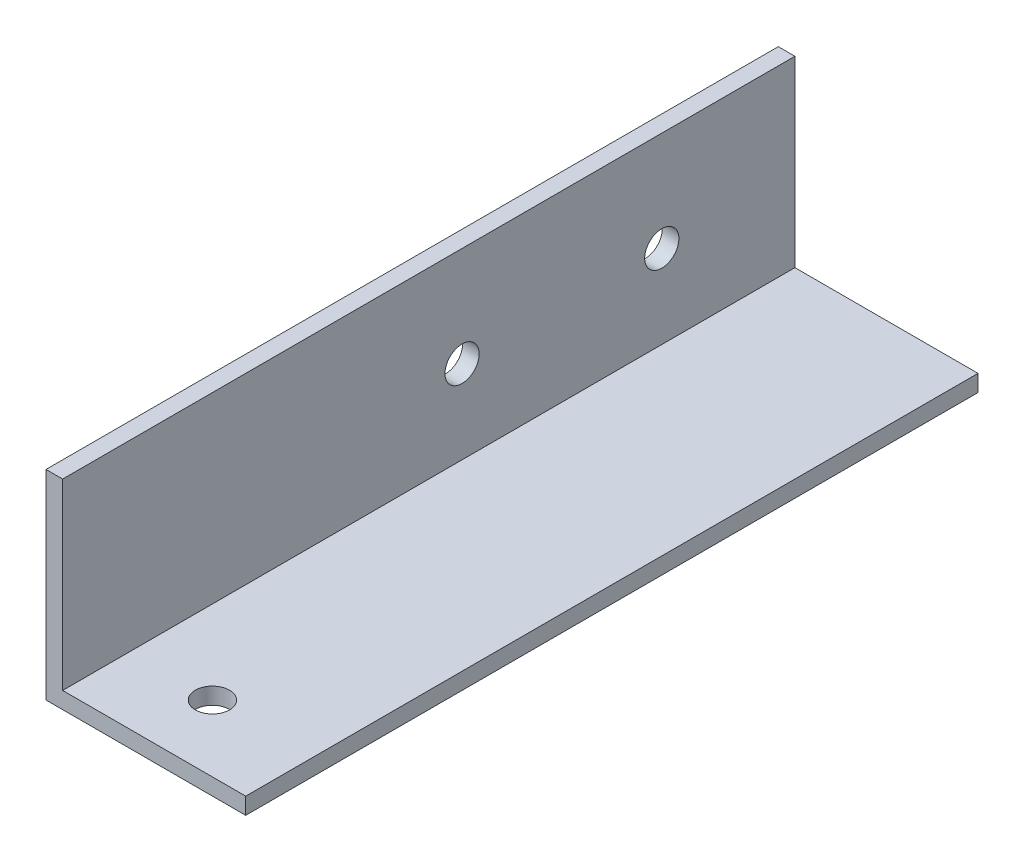
ISO-10303-21;
HEADER;
FILE_DESCRIPTION(('STEP AP214'),'2;1');
FILE_NAME('part.step','',(''),(''),'','','');
FILE_SCHEMA(('AUTOMOTIVE_DESIGN { 1 0 10303 214 1 1 1 1 }'));
ENDSEC;
DATA;
#1=APPLICATION_CONTEXT('core data for automotive mechanical design processes');
#2=APPLICATION_PROTOCOL_DEFINITION('international standard','automotive_design',2000,#1);
#3=PRODUCT_CONTEXT('',#1,'mechanical');
#4=PRODUCT('Part','Part','',(#3));
#5=PRODUCT_RELATED_PRODUCT_CATEGORY('part','',(#4));
#6=PRODUCT_DEFINITION_FORMATION('','',#4);
#7=PRODUCT_DEFINITION_CONTEXT('part definition',#1,'design');
#8=PRODUCT_DEFINITION('design','',#6,#7);
#9=PRODUCT_DEFINITION_SHAPE('','',#8);
#10=(LENGTH_UNIT() NAMED_UNIT(*) SI_UNIT(.MILLI.,.METRE.));
#11=(NAMED_UNIT(*) PLANE_ANGLE_UNIT() SI_UNIT($,.RADIAN.));
#12=(NAMED_UNIT(*) SI_UNIT($,.STERADIAN.) SOLID_ANGLE_UNIT());
#13=UNCERTAINTY_MEASURE_WITH_UNIT(LENGTH_MEASURE(1.E-05),#10,'distance_accuracy_value','');
#14=(GEOMETRIC_REPRESENTATION_CONTEXT(3) GLOBAL_UNCERTAINTY_ASSIGNED_CONTEXT((#13)) GLOBAL_UNIT_ASSIGNED_CONTEXT((#10,
#11,#12)) REPRESENTATION_CONTEXT('',''));
#15=CARTESIAN_POINT('',(0.,0.,0.));
#16=DIRECTION('',(0.,0.,1.));
#17=DIRECTION('',(1.,0.,0.));
#18=AXIS2_PLACEMENT_3D('',#15,#16,#17);
#19=CARTESIAN_POINT('',(19.05,0.,69.85));
#20=DIRECTION('',(0.,1.,0.));
#21=DIRECTION('',(-1.,0.,0.));
#22=AXIS2_PLACEMENT_3D('',#19,#20,#21);
#23=PLANE('',#22);
#24=CARTESIAN_POINT('',(9.525,0.,63.5));
#25=DIRECTION('',(0.,1.,0.));
#26=DIRECTION('',(0.,0.,1.));
#27=AXIS2_PLACEMENT_3D('',#24,#25,#26);
#28=CIRCLE('',#27,1.63195);
#29=CARTESIAN_POINT('',(9.525,0.,65.13195));
#30=VERTEX_POINT('',#29);
#31=EDGE_CURVE('E163',#30,#30,#28,.T.);
#32=ORIENTED_EDGE('',*,*,#31,.T.);
#33=EDGE_LOOP('',(#32));
#34=FACE_BOUND('',#33,.T.);
#35=DIRECTION('',(1.,0.,0.));
#36=VECTOR('',#35,1.);
#37=CARTESIAN_POINT('',(19.05,0.,0.));
#38=LINE('',#37,#36);
#39=CARTESIAN_POINT('',(0.,0.,0.));
#40=VERTEX_POINT('',#39);
#41=CARTESIAN_POINT('',(19.05,0.,0.));
#42=VERTEX_POINT('',#41);
#43=EDGE_CURVE('E118',#40,#42,#38,.T.);
#44=ORIENTED_EDGE('',*,*,#43,.T.);
#45=DIRECTION('',(0.,0.,-1.));
#46=VECTOR('',#45,1.);
#47=CARTESIAN_POINT('',(19.05,0.,69.85));
#48=LINE('',#47,#46);
#49=CARTESIAN_POINT('',(19.05,0.,69.85));
#50=VERTEX_POINT('',#49);
#51=EDGE_CURVE('E11',#50,#42,#48,.T.);
#52=ORIENTED_EDGE('',*,*,#51,.F.);
#53=DIRECTION('',(1.,0.,0.));
#54=VECTOR('',#53,1.);
#55=CARTESIAN_POINT('',(19.05,0.,69.85));
#56=LINE('',#55,#54);
#57=CARTESIAN_POINT('',(0.,0.,69.85));
#58=VERTEX_POINT('',#57);
#59=EDGE_CURVE('E129',#58,#50,#56,.T.);
#60=ORIENTED_EDGE('',*,*,#59,.F.);
#61=DIRECTION('',(0.,0.,-1.));
#62=VECTOR('',#61,1.);
#63=CARTESIAN_POINT('',(0.,0.,69.85));
#64=LINE('',#63,#62);
#65=EDGE_CURVE('E114',#58,#40,#64,.T.);
#66=ORIENTED_EDGE('',*,*,#65,.T.);
#67=EDGE_LOOP('',(#44,#52,#60,#66));
#68=FACE_BOUND('',#67,.T.);
#69=ADVANCED_FACE('F34',(#34,#68),#23,.F.);
#70=CARTESIAN_POINT('',(19.05,1.5875,69.85));
#71=DIRECTION('',(-1.,0.,0.));
#72=DIRECTION('',(0.,0.,1.));
#73=AXIS2_PLACEMENT_3D('',#70,#71,#72);
#74=PLANE('',#73);
#75=DIRECTION('',(0.,1.,0.));
#76=VECTOR('',#75,1.);
#77=CARTESIAN_POINT('',(19.05,1.5875,0.));
#78=LINE('',#77,#76);
#79=CARTESIAN_POINT('',(19.05,1.5875,0.));
#80=VERTEX_POINT('',#79);
#81=EDGE_CURVE('E121',#42,#80,#78,.T.);
#82=ORIENTED_EDGE('',*,*,#81,.T.);
#83=DIRECTION('',(0.,0.,-1.));
#84=VECTOR('',#83,1.);
#85=CARTESIAN_POINT('',(19.05,1.5875,69.85));
#86=LINE('',#85,#84);
#87=CARTESIAN_POINT('',(19.05,1.5875,69.85));
#88=VERTEX_POINT('',#87);
#89=EDGE_CURVE('E42',#88,#80,#86,.T.);
#90=ORIENTED_EDGE('',*,*,#89,.F.);
#91=DIRECTION('',(0.,1.,0.));
#92=VECTOR('',#91,1.);
#93=CARTESIAN_POINT('',(19.05,1.5875,69.85));
#94=LINE('',#93,#92);
#95=EDGE_CURVE('E87',#50,#88,#94,.T.);
#96=ORIENTED_EDGE('',*,*,#95,.F.);
#97=ORIENTED_EDGE('',*,*,#51,.T.);
#98=EDGE_LOOP('',(#82,#90,#96,#97));
#99=FACE_BOUND('',#98,.T.);
#100=ADVANCED_FACE('F156',(#99),#74,.F.);
#101=CARTESIAN_POINT('',(1.5875,1.5875,69.85));
#102=DIRECTION('',(0.,-1.,0.));
#103=DIRECTION('',(0.,0.,-1.));
#104=AXIS2_PLACEMENT_3D('',#101,#102,#103);
#105=PLANE('',#104);
#106=CARTESIAN_POINT('',(9.525,1.5875,63.5));
#107=DIRECTION('',(0.,1.,0.));
#108=DIRECTION('',(0.,0.,1.));
#109=AXIS2_PLACEMENT_3D('',#106,#107,#108);
#110=CIRCLE('',#109,1.63194999999999);
#111=CARTESIAN_POINT('',(9.525,1.5875,65.13195));
#112=VERTEX_POINT('',#111);
#113=EDGE_CURVE('E166',#112,#112,#110,.T.);
#114=ORIENTED_EDGE('',*,*,#113,.F.);
#115=EDGE_LOOP('',(#114));
#116=FACE_BOUND('',#115,.T.);
#117=DIRECTION('',(-1.,0.,0.));
#118=VECTOR('',#117,1.);
#119=CARTESIAN_POINT('',(1.5875,1.5875,0.));
#120=LINE('',#119,#118);
#121=CARTESIAN_POINT('',(1.5875,1.5875,0.));
#122=VERTEX_POINT('',#121);
#123=EDGE_CURVE('E124',#80,#122,#120,.T.);
#124=ORIENTED_EDGE('',*,*,#123,.T.);
#125=DIRECTION('',(0.,0.,-1.));
#126=VECTOR('',#125,1.);
#127=CARTESIAN_POINT('',(1.5875,1.5875,69.85));
#128=LINE('',#127,#126);
#129=CARTESIAN_POINT('',(1.5875,1.5875,69.85));
#130=VERTEX_POINT('',#129);
#131=EDGE_CURVE('E109',#130,#122,#128,.T.);
#132=ORIENTED_EDGE('',*,*,#131,.F.);
#133=DIRECTION('',(-1.,0.,0.));
#134=VECTOR('',#133,1.);
#135=CARTESIAN_POINT('',(1.5875,1.5875,69.85));
#136=LINE('',#135,#134);
#137=EDGE_CURVE('E100',#88,#130,#136,.T.);
#138=ORIENTED_EDGE('',*,*,#137,.F.);
#139=ORIENTED_EDGE('',*,*,#89,.T.);
#140=EDGE_LOOP('',(#124,#132,#138,#139));
#141=FACE_BOUND('',#140,.T.);
#142=ADVANCED_FACE('F135',(#116,#141),#105,.F.);
#143=CARTESIAN_POINT('',(1.5875,19.05,69.85));
#144=DIRECTION('',(-1.,0.,0.));
#145=DIRECTION('',(0.,-1.,0.));
#146=AXIS2_PLACEMENT_3D('',#143,#144,#145);
#147=PLANE('',#146);
#148=CARTESIAN_POINT('',(1.5875,9.525,12.7));
#149=DIRECTION('',(1.,0.,0.));
#150=DIRECTION('',(0.,0.,-1.));
#151=AXIS2_PLACEMENT_3D('',#148,#149,#150);
#152=CIRCLE('',#151,1.63195);
#153=CARTESIAN_POINT('',(1.5875,9.525,11.06805));
#154=VERTEX_POINT('',#153);
#155=EDGE_CURVE('E165',#154,#154,#152,.T.);
#156=ORIENTED_EDGE('',*,*,#155,.F.);
#157=EDGE_LOOP('',(#156));
#158=FACE_BOUND('',#157,.T.);
#159=CARTESIAN_POINT('',(1.5875,9.525,31.75));
#160=DIRECTION('',(1.,0.,0.));
#161=DIRECTION('',(0.,0.,-1.));
#162=AXIS2_PLACEMENT_3D('',#159,#160,#161);
#163=CIRCLE('',#162,1.63195);
#164=CARTESIAN_POINT('',(1.5875,9.525,30.11805));
#165=VERTEX_POINT('',#164);
#166=EDGE_CURVE('E175',#165,#165,#163,.T.);
#167=ORIENTED_EDGE('',*,*,#166,.F.);
#168=EDGE_LOOP('',(#167));
#169=FACE_BOUND('',#168,.T.);
#170=DIRECTION('',(0.,1.,0.));
#171=VECTOR('',#170,1.);
#172=CARTESIAN_POINT('',(1.5875,19.05,0.));
#173=LINE('',#172,#171);
#174=CARTESIAN_POINT('',(1.5875,19.05,0.));
#175=VERTEX_POINT('',#174);
#176=EDGE_CURVE('E108',#122,#175,#173,.T.);
#177=ORIENTED_EDGE('',*,*,#176,.T.);
#178=DIRECTION('',(0.,0.,-1.));
#179=VECTOR('',#178,1.);
#180=CARTESIAN_POINT('',(1.5875,19.05,69.85));
#181=LINE('',#180,#179);
#182=CARTESIAN_POINT('',(1.5875,19.05,69.85));
#183=VERTEX_POINT('',#182);
#184=EDGE_CURVE('E105',#183,#175,#181,.T.);
#185=ORIENTED_EDGE('',*,*,#184,.F.);
#186=DIRECTION('',(0.,1.,0.));
#187=VECTOR('',#186,1.);
#188=CARTESIAN_POINT('',(1.5875,19.05,69.85));
#189=LINE('',#188,#187);
#190=EDGE_CURVE('E94',#130,#183,#189,.T.);
#191=ORIENTED_EDGE('',*,*,#190,.F.);
#192=ORIENTED_EDGE('',*,*,#131,.T.);
#193=EDGE_LOOP('',(#177,#185,#191,#192));
#194=FACE_BOUND('',#193,.T.);
#195=ADVANCED_FACE('F106',(#158,#169,#194),#147,.F.);
#196=CARTESIAN_POINT('',(0.,19.05,69.85));
#197=DIRECTION('',(0.,-1.,0.));
#198=DIRECTION('',(0.,0.,-1.));
#199=AXIS2_PLACEMENT_3D('',#196,#197,#198);
#200=PLANE('',#199);
#201=DIRECTION('',(-1.,0.,0.));
#202=VECTOR('',#201,1.);
#203=CARTESIAN_POINT('',(0.,19.05,0.));
#204=LINE('',#203,#202);
#205=CARTESIAN_POINT('',(0.,19.05,0.));
#206=VERTEX_POINT('',#205);
#207=EDGE_CURVE('E73',#175,#206,#204,.T.);
#208=ORIENTED_EDGE('',*,*,#207,.T.);
#209=DIRECTION('',(0.,0.,-1.));
#210=VECTOR('',#209,1.);
#211=CARTESIAN_POINT('',(0.,19.05,69.85));
#212=LINE('',#211,#210);
#213=CARTESIAN_POINT('',(0.,19.05,69.85));
#214=VERTEX_POINT('',#213);
#215=EDGE_CURVE('E110',#214,#206,#212,.T.);
#216=ORIENTED_EDGE('',*,*,#215,.F.);
#217=DIRECTION('',(-1.,0.,0.));
#218=VECTOR('',#217,1.);
#219=CARTESIAN_POINT('',(0.,19.05,69.85));
#220=LINE('',#219,#218);
#221=EDGE_CURVE('E98',#183,#214,#220,.T.);
#222=ORIENTED_EDGE('',*,*,#221,.F.);
#223=ORIENTED_EDGE('',*,*,#184,.T.);
#224=EDGE_LOOP('',(#208,#216,#222,#223));
#225=FACE_BOUND('',#224,.T.);
#226=ADVANCED_FACE('F112',(#225),#200,.F.);
#227=CARTESIAN_POINT('',(0.,0.,69.85));
#228=DIRECTION('',(1.,0.,0.));
#229=DIRECTION('',(0.,0.,-1.));
#230=AXIS2_PLACEMENT_3D('',#227,#228,#229);
#231=PLANE('',#230);
#232=CARTESIAN_POINT('',(0.,9.525,12.7));
#233=DIRECTION('',(1.,0.,0.));
#234=DIRECTION('',(0.,0.,-1.));
#235=AXIS2_PLACEMENT_3D('',#232,#233,#234);
#236=CIRCLE('',#235,1.63195);
#237=CARTESIAN_POINT('',(0.,9.525,11.06805));
#238=VERTEX_POINT('',#237);
#239=EDGE_CURVE('E169',#238,#238,#236,.T.);
#240=ORIENTED_EDGE('',*,*,#239,.T.);
#241=EDGE_LOOP('',(#240));
#242=FACE_BOUND('',#241,.T.);
#243=CARTESIAN_POINT('',(0.,9.525,31.75));
#244=DIRECTION('',(1.,0.,0.));
#245=DIRECTION('',(0.,0.,-1.));
#246=AXIS2_PLACEMENT_3D('',#243,#244,#245);
#247=CIRCLE('',#246,1.63195);
#248=CARTESIAN_POINT('',(0.,9.525,30.11805));
#249=VERTEX_POINT('',#248);
#250=EDGE_CURVE('E122',#249,#249,#247,.T.);
#251=ORIENTED_EDGE('',*,*,#250,.T.);
#252=EDGE_LOOP('',(#251));
#253=FACE_BOUND('',#252,.T.);
#254=DIRECTION('',(0.,-1.,0.));
#255=VECTOR('',#254,1.);
#256=CARTESIAN_POINT('',(0.,0.,0.));
#257=LINE('',#256,#255);
#258=EDGE_CURVE('E79',#206,#40,#257,.T.);
#259=ORIENTED_EDGE('',*,*,#258,.T.);
#260=ORIENTED_EDGE('',*,*,#65,.F.);
#261=DIRECTION('',(0.,-1.,0.));
#262=VECTOR('',#261,1.);
#263=CARTESIAN_POINT('',(0.,0.,69.85));
#264=LINE('',#263,#262);
#265=EDGE_CURVE('E50',#214,#58,#264,.T.);
#266=ORIENTED_EDGE('',*,*,#265,.F.);
#267=ORIENTED_EDGE('',*,*,#215,.T.);
#268=EDGE_LOOP('',(#259,#260,#266,#267));
#269=FACE_BOUND('',#268,.T.);
#270=ADVANCED_FACE('F142',(#242,#253,#269),#231,.F.);
#271=CARTESIAN_POINT('',(0.,0.,69.85));
#272=DIRECTION('',(0.,0.,-1.));
#273=DIRECTION('',(-1.,0.,0.));
#274=AXIS2_PLACEMENT_3D('',#271,#272,#273);
#275=PLANE('',#274);
#276=ORIENTED_EDGE('',*,*,#59,.T.);
#277=ORIENTED_EDGE('',*,*,#95,.T.);
#278=ORIENTED_EDGE('',*,*,#137,.T.);
#279=ORIENTED_EDGE('',*,*,#190,.T.);
#280=ORIENTED_EDGE('',*,*,#221,.T.);
#281=ORIENTED_EDGE('',*,*,#265,.T.);
#282=EDGE_LOOP('',(#276,#277,#278,#279,#280,#281));
#283=FACE_BOUND('',#282,.T.);
#284=ADVANCED_FACE('F96',(#283),#275,.F.);
#285=CARTESIAN_POINT('',(0.,0.,0.));
#286=DIRECTION('',(0.,0.,-1.));
#287=DIRECTION('',(-1.,0.,0.));
#288=AXIS2_PLACEMENT_3D('',#285,#286,#287);
#289=PLANE('',#288);
#290=ORIENTED_EDGE('',*,*,#43,.F.);
#291=ORIENTED_EDGE('',*,*,#258,.F.);
#292=ORIENTED_EDGE('',*,*,#207,.F.);
#293=ORIENTED_EDGE('',*,*,#176,.F.);
#294=ORIENTED_EDGE('',*,*,#123,.F.);
#295=ORIENTED_EDGE('',*,*,#81,.F.);
#296=EDGE_LOOP('',(#290,#291,#292,#293,#294,#295));
#297=FACE_BOUND('',#296,.T.);
#298=ADVANCED_FACE('F138',(#297),#289,.T.);
#299=CARTESIAN_POINT('',(1.5875,9.525,31.75));
#300=DIRECTION('',(1.,0.,0.));
#301=DIRECTION('',(0.,0.,-1.));
#302=AXIS2_PLACEMENT_3D('',#299,#300,#301);
#303=CYLINDRICAL_SURFACE('',#302,1.63195);
#304=ORIENTED_EDGE('',*,*,#250,.F.);
#305=EDGE_LOOP('',(#304));
#306=FACE_BOUND('',#305,.T.);
#307=ORIENTED_EDGE('',*,*,#166,.T.);
#308=EDGE_LOOP('',(#307));
#309=FACE_BOUND('',#308,.T.);
#310=ADVANCED_FACE('F183',(#306,#309),#303,.F.);
#311=CARTESIAN_POINT('',(1.5875,9.525,12.7));
#312=DIRECTION('',(1.,0.,0.));
#313=DIRECTION('',(0.,0.,-1.));
#314=AXIS2_PLACEMENT_3D('',#311,#312,#313);
#315=CYLINDRICAL_SURFACE('',#314,1.63195);
#316=ORIENTED_EDGE('',*,*,#239,.F.);
#317=EDGE_LOOP('',(#316));
#318=FACE_BOUND('',#317,.T.);
#319=ORIENTED_EDGE('',*,*,#155,.T.);
#320=EDGE_LOOP('',(#319));
#321=FACE_BOUND('',#320,.T.);
#322=ADVANCED_FACE('F186',(#318,#321),#315,.F.);
#323=CARTESIAN_POINT('',(9.525,1.5875,63.5));
#324=DIRECTION('',(0.,1.,0.));
#325=DIRECTION('',(0.,0.,1.));
#326=AXIS2_PLACEMENT_3D('',#323,#324,#325);
#327=CYLINDRICAL_SURFACE('',#326,1.63194999999999);
#328=ORIENTED_EDGE('',*,*,#31,.F.);
#329=EDGE_LOOP('',(#328));
#330=FACE_BOUND('',#329,.T.);
#331=ORIENTED_EDGE('',*,*,#113,.T.);
#332=EDGE_LOOP('',(#331));
#333=FACE_BOUND('',#332,.T.);
#334=ADVANCED_FACE('F201',(#330,#333),#327,.F.);
#335=CLOSED_SHELL('',(#69,#100,#142,#195,#226,#270,#284,#298,#310,#322,#334));
#336=MANIFOLD_SOLID_BREP('B2',#335);
#337=ADVANCED_BREP_SHAPE_REPRESENTATION('',(#18,#336),#14);
#338=SHAPE_DEFINITION_REPRESENTATION(#9,#337);
ENDSEC;
END-ISO-10303-21;
